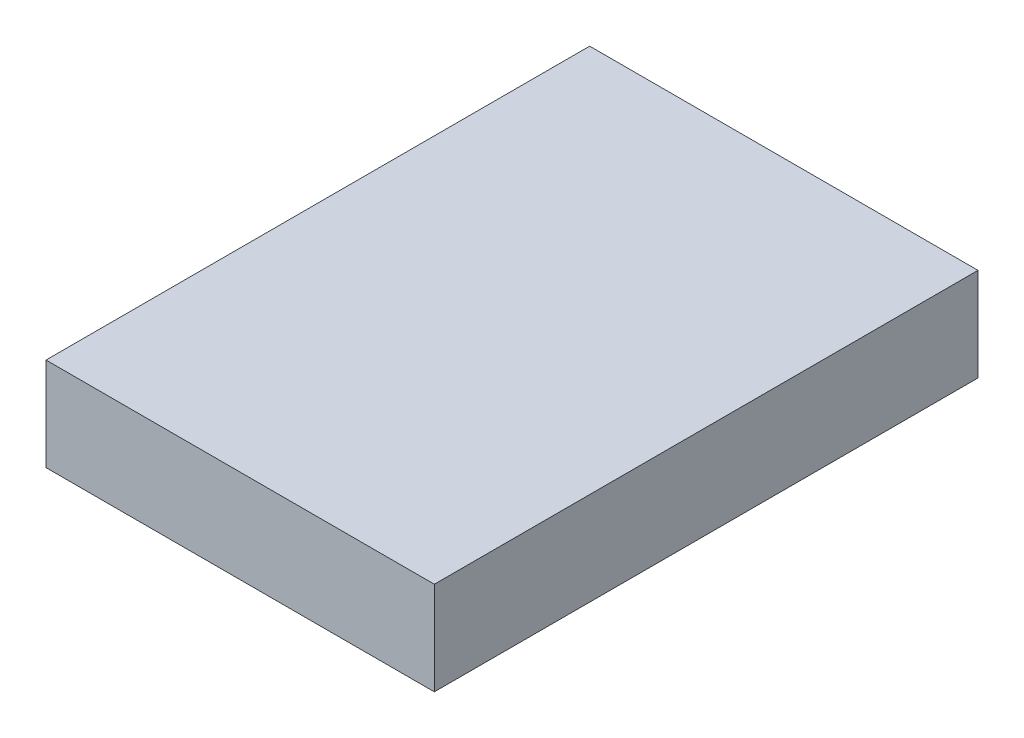
ISO-10303-21;
HEADER;
FILE_DESCRIPTION(('STEP AP214'),'2;1');
FILE_NAME('part.step','',(''),(''),'','','');
FILE_SCHEMA(('AUTOMOTIVE_DESIGN { 1 0 10303 214 1 1 1 1 }'));
ENDSEC;
DATA;
#1=APPLICATION_CONTEXT('core data for automotive mechanical design processes');
#2=APPLICATION_PROTOCOL_DEFINITION('international standard','automotive_design',2000,#1);
#3=PRODUCT_CONTEXT('',#1,'mechanical');
#4=PRODUCT('Part','Part','',(#3));
#5=PRODUCT_RELATED_PRODUCT_CATEGORY('part','',(#4));
#6=PRODUCT_DEFINITION_FORMATION('','',#4);
#7=PRODUCT_DEFINITION_CONTEXT('part definition',#1,'design');
#8=PRODUCT_DEFINITION('design','',#6,#7);
#9=PRODUCT_DEFINITION_SHAPE('','',#8);
#10=(LENGTH_UNIT() NAMED_UNIT(*) SI_UNIT(.MILLI.,.METRE.));
#11=(NAMED_UNIT(*) PLANE_ANGLE_UNIT() SI_UNIT($,.RADIAN.));
#12=(NAMED_UNIT(*) SI_UNIT($,.STERADIAN.) SOLID_ANGLE_UNIT());
#13=UNCERTAINTY_MEASURE_WITH_UNIT(LENGTH_MEASURE(1.E-05),#10,'distance_accuracy_value','');
#14=(GEOMETRIC_REPRESENTATION_CONTEXT(3) GLOBAL_UNCERTAINTY_ASSIGNED_CONTEXT((#13)) GLOBAL_UNIT_ASSIGNED_CONTEXT((#10,
#11,#12)) REPRESENTATION_CONTEXT('',''));
#15=CARTESIAN_POINT('',(0.,0.,0.));
#16=DIRECTION('',(0.,0.,1.));
#17=DIRECTION('',(1.,0.,0.));
#18=AXIS2_PLACEMENT_3D('',#15,#16,#17);
#19=CARTESIAN_POINT('',(6.25,3.,-8.75));
#20=DIRECTION('',(-1.,0.,0.));
#21=DIRECTION('',(0.,0.,1.));
#22=AXIS2_PLACEMENT_3D('',#19,#20,#21);
#23=PLANE('',#22);
#24=DIRECTION('',(0.,0.,-1.));
#25=VECTOR('',#24,1.);
#26=CARTESIAN_POINT('',(6.25,0.,-8.75));
#27=LINE('',#26,#25);
#28=CARTESIAN_POINT('',(6.25,0.,8.75));
#29=VERTEX_POINT('',#28);
#30=CARTESIAN_POINT('',(6.25,0.,-8.75));
#31=VERTEX_POINT('',#30);
#32=EDGE_CURVE('E100',#29,#31,#27,.T.);
#33=ORIENTED_EDGE('',*,*,#32,.T.);
#34=DIRECTION('',(0.,-1.,0.));
#35=VECTOR('',#34,1.);
#36=CARTESIAN_POINT('',(6.25,3.,-8.75));
#37=LINE('',#36,#35);
#38=CARTESIAN_POINT('',(6.25,3.,-8.75));
#39=VERTEX_POINT('',#38);
#40=EDGE_CURVE('E11',#39,#31,#37,.T.);
#41=ORIENTED_EDGE('',*,*,#40,.F.);
#42=DIRECTION('',(0.,0.,-1.));
#43=VECTOR('',#42,1.);
#44=CARTESIAN_POINT('',(6.25,3.,-8.75));
#45=LINE('',#44,#43);
#46=CARTESIAN_POINT('',(6.25,3.,8.75));
#47=VERTEX_POINT('',#46);
#48=EDGE_CURVE('E88',#47,#39,#45,.T.);
#49=ORIENTED_EDGE('',*,*,#48,.F.);
#50=DIRECTION('',(0.,-1.,0.));
#51=VECTOR('',#50,1.);
#52=CARTESIAN_POINT('',(6.25,3.,8.75));
#53=LINE('',#52,#51);
#54=EDGE_CURVE('E96',#47,#29,#53,.T.);
#55=ORIENTED_EDGE('',*,*,#54,.T.);
#56=EDGE_LOOP('',(#33,#41,#49,#55));
#57=FACE_BOUND('',#56,.T.);
#58=ADVANCED_FACE('F37',(#57),#23,.F.);
#59=CARTESIAN_POINT('',(-6.25,3.,-8.75));
#60=DIRECTION('',(0.,0.,1.));
#61=DIRECTION('',(1.,0.,0.));
#62=AXIS2_PLACEMENT_3D('',#59,#60,#61);
#63=PLANE('',#62);
#64=DIRECTION('',(-1.,0.,0.));
#65=VECTOR('',#64,1.);
#66=CARTESIAN_POINT('',(-6.25,0.,-8.75));
#67=LINE('',#66,#65);
#68=CARTESIAN_POINT('',(-6.25,0.,-8.75));
#69=VERTEX_POINT('',#68);
#70=EDGE_CURVE('E92',#31,#69,#67,.T.);
#71=ORIENTED_EDGE('',*,*,#70,.T.);
#72=DIRECTION('',(0.,-1.,0.));
#73=VECTOR('',#72,1.);
#74=CARTESIAN_POINT('',(-6.25,3.,-8.75));
#75=LINE('',#74,#73);
#76=CARTESIAN_POINT('',(-6.25,3.,-8.75));
#77=VERTEX_POINT('',#76);
#78=EDGE_CURVE('E45',#77,#69,#75,.T.);
#79=ORIENTED_EDGE('',*,*,#78,.F.);
#80=DIRECTION('',(-1.,0.,0.));
#81=VECTOR('',#80,1.);
#82=CARTESIAN_POINT('',(-6.25,3.,-8.75));
#83=LINE('',#82,#81);
#84=EDGE_CURVE('E83',#39,#77,#83,.T.);
#85=ORIENTED_EDGE('',*,*,#84,.F.);
#86=ORIENTED_EDGE('',*,*,#40,.T.);
#87=EDGE_LOOP('',(#71,#79,#85,#86));
#88=FACE_BOUND('',#87,.T.);
#89=ADVANCED_FACE('F91',(#88),#63,.F.);
#90=CARTESIAN_POINT('',(-6.25,3.,-8.75));
#91=DIRECTION('',(1.,0.,0.));
#92=DIRECTION('',(0.,0.,-1.));
#93=AXIS2_PLACEMENT_3D('',#90,#91,#92);
#94=PLANE('',#93);
#95=DIRECTION('',(0.,0.,1.));
#96=VECTOR('',#95,1.);
#97=CARTESIAN_POINT('',(-6.25,0.,-8.75));
#98=LINE('',#97,#96);
#99=CARTESIAN_POINT('',(-6.25,0.,8.75));
#100=VERTEX_POINT('',#99);
#101=EDGE_CURVE('E70',#69,#100,#98,.T.);
#102=ORIENTED_EDGE('',*,*,#101,.T.);
#103=DIRECTION('',(0.,-1.,0.));
#104=VECTOR('',#103,1.);
#105=CARTESIAN_POINT('',(-6.25,3.,8.75));
#106=LINE('',#105,#104);
#107=CARTESIAN_POINT('',(-6.25,3.,8.75));
#108=VERTEX_POINT('',#107);
#109=EDGE_CURVE('E93',#108,#100,#106,.T.);
#110=ORIENTED_EDGE('',*,*,#109,.F.);
#111=DIRECTION('',(0.,0.,1.));
#112=VECTOR('',#111,1.);
#113=CARTESIAN_POINT('',(-6.25,3.,-8.75));
#114=LINE('',#113,#112);
#115=EDGE_CURVE('E86',#77,#108,#114,.T.);
#116=ORIENTED_EDGE('',*,*,#115,.F.);
#117=ORIENTED_EDGE('',*,*,#78,.T.);
#118=EDGE_LOOP('',(#102,#110,#116,#117));
#119=FACE_BOUND('',#118,.T.);
#120=ADVANCED_FACE('F94',(#119),#94,.F.);
#121=CARTESIAN_POINT('',(-6.25,3.,8.75));
#122=DIRECTION('',(0.,0.,-1.));
#123=DIRECTION('',(-1.,0.,0.));
#124=AXIS2_PLACEMENT_3D('',#121,#122,#123);
#125=PLANE('',#124);
#126=DIRECTION('',(1.,0.,0.));
#127=VECTOR('',#126,1.);
#128=CARTESIAN_POINT('',(-6.25,0.,8.75));
#129=LINE('',#128,#127);
#130=EDGE_CURVE('E76',#100,#29,#129,.T.);
#131=ORIENTED_EDGE('',*,*,#130,.T.);
#132=ORIENTED_EDGE('',*,*,#54,.F.);
#133=DIRECTION('',(1.,0.,0.));
#134=VECTOR('',#133,1.);
#135=CARTESIAN_POINT('',(-6.25,3.,8.75));
#136=LINE('',#135,#134);
#137=EDGE_CURVE('E53',#108,#47,#136,.T.);
#138=ORIENTED_EDGE('',*,*,#137,.F.);
#139=ORIENTED_EDGE('',*,*,#109,.T.);
#140=EDGE_LOOP('',(#131,#132,#138,#139));
#141=FACE_BOUND('',#140,.T.);
#142=ADVANCED_FACE('F107',(#141),#125,.F.);
#143=CARTESIAN_POINT('',(0.,3.,0.));
#144=DIRECTION('',(0.,1.,0.));
#145=DIRECTION('',(0.,0.,1.));
#146=AXIS2_PLACEMENT_3D('',#143,#144,#145);
#147=PLANE('',#146);
#148=ORIENTED_EDGE('',*,*,#48,.T.);
#149=ORIENTED_EDGE('',*,*,#84,.T.);
#150=ORIENTED_EDGE('',*,*,#115,.T.);
#151=ORIENTED_EDGE('',*,*,#137,.T.);
#152=EDGE_LOOP('',(#148,#149,#150,#151));
#153=FACE_BOUND('',#152,.T.);
#154=ADVANCED_FACE('F84',(#153),#147,.T.);
#155=CARTESIAN_POINT('',(0.,0.,0.));
#156=DIRECTION('',(0.,1.,0.));
#157=DIRECTION('',(0.,0.,1.));
#158=AXIS2_PLACEMENT_3D('',#155,#156,#157);
#159=PLANE('',#158);
#160=ORIENTED_EDGE('',*,*,#32,.F.);
#161=ORIENTED_EDGE('',*,*,#130,.F.);
#162=ORIENTED_EDGE('',*,*,#101,.F.);
#163=ORIENTED_EDGE('',*,*,#70,.F.);
#164=EDGE_LOOP('',(#160,#161,#162,#163));
#165=FACE_BOUND('',#164,.T.);
#166=ADVANCED_FACE('F110',(#165),#159,.F.);
#167=CLOSED_SHELL('',(#58,#89,#120,#142,#154,#166));
#168=MANIFOLD_SOLID_BREP('B2',#167);
#169=ADVANCED_BREP_SHAPE_REPRESENTATION('',(#18,#168),#14);
#170=SHAPE_DEFINITION_REPRESENTATION(#9,#169);
ENDSEC;
END-ISO-10303-21;
